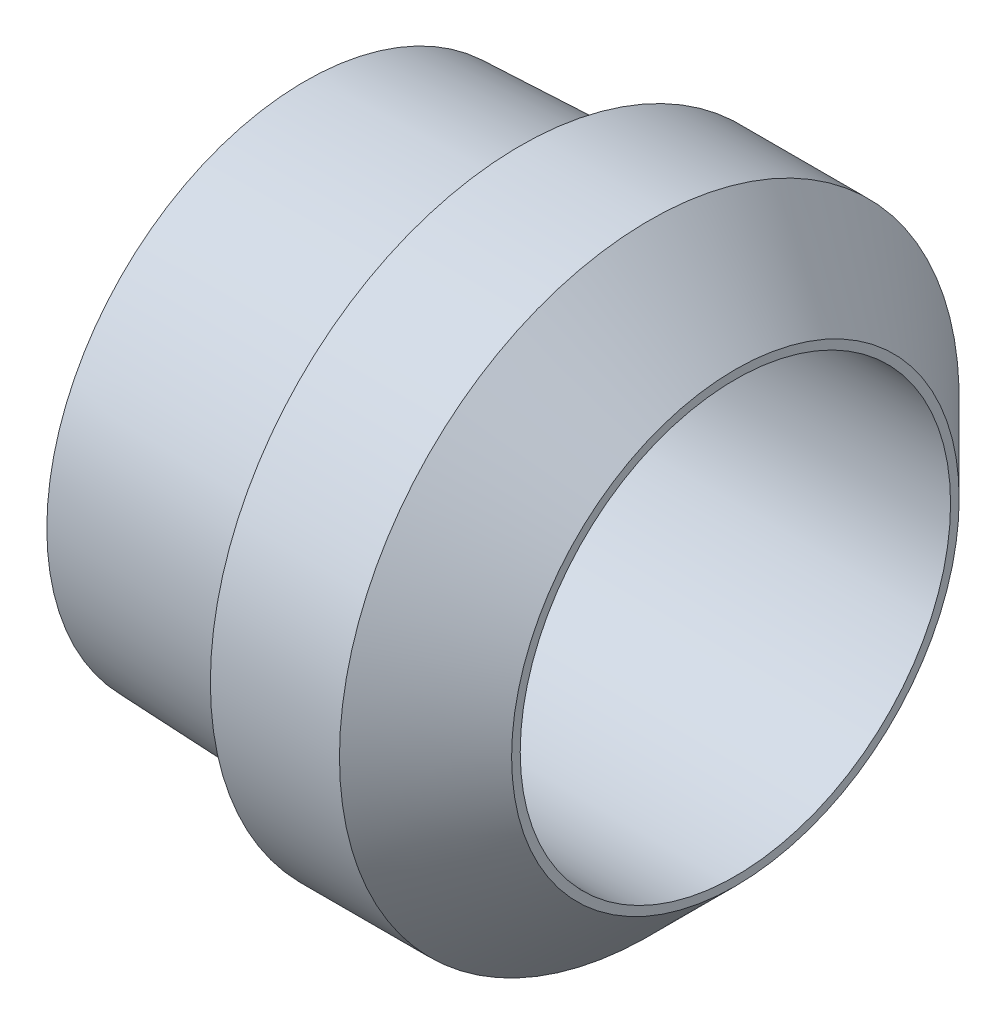
ISO-10303-21;
HEADER;
FILE_DESCRIPTION(('STEP AP214'),'2;1');
FILE_NAME('part.step','',(''),(''),'','','');
FILE_SCHEMA(('AUTOMOTIVE_DESIGN { 1 0 10303 214 1 1 1 1 }'));
ENDSEC;
DATA;
#1=APPLICATION_CONTEXT('core data for automotive mechanical design processes');
#2=APPLICATION_PROTOCOL_DEFINITION('international standard','automotive_design',2000,#1);
#3=PRODUCT_CONTEXT('',#1,'mechanical');
#4=PRODUCT('Part','Part','',(#3));
#5=PRODUCT_RELATED_PRODUCT_CATEGORY('part','',(#4));
#6=PRODUCT_DEFINITION_FORMATION('','',#4);
#7=PRODUCT_DEFINITION_CONTEXT('part definition',#1,'design');
#8=PRODUCT_DEFINITION('design','',#6,#7);
#9=PRODUCT_DEFINITION_SHAPE('','',#8);
#10=(LENGTH_UNIT() NAMED_UNIT(*) SI_UNIT(.MILLI.,.METRE.));
#11=(NAMED_UNIT(*) PLANE_ANGLE_UNIT() SI_UNIT($,.RADIAN.));
#12=(NAMED_UNIT(*) SI_UNIT($,.STERADIAN.) SOLID_ANGLE_UNIT());
#13=UNCERTAINTY_MEASURE_WITH_UNIT(LENGTH_MEASURE(1.E-05),#10,'distance_accuracy_value','');
#14=(GEOMETRIC_REPRESENTATION_CONTEXT(3) GLOBAL_UNCERTAINTY_ASSIGNED_CONTEXT((#13)) GLOBAL_UNIT_ASSIGNED_CONTEXT((#10,
#11,#12)) REPRESENTATION_CONTEXT('',''));
#15=CARTESIAN_POINT('',(0.,0.,0.));
#16=DIRECTION('',(0.,0.,1.));
#17=DIRECTION('',(1.,0.,0.));
#18=AXIS2_PLACEMENT_3D('',#15,#16,#17);
#19=CARTESIAN_POINT('',(-12.,0.,0.));
#20=DIRECTION('',(-1.,0.,0.));
#21=DIRECTION('',(0.,0.,1.));
#22=AXIS2_PLACEMENT_3D('',#19,#20,#21);
#23=CYLINDRICAL_SURFACE('',#22,5.);
#24=CARTESIAN_POINT('',(10.,0.,0.));
#25=DIRECTION('',(-1.,0.,0.));
#26=DIRECTION('',(0.,0.,1.));
#27=AXIS2_PLACEMENT_3D('',#24,#25,#26);
#28=CIRCLE('',#27,5.);
#29=CARTESIAN_POINT('',(10.,0.,5.));
#30=VERTEX_POINT('',#29);
#31=EDGE_CURVE('E60',#30,#30,#28,.T.);
#32=ORIENTED_EDGE('',*,*,#31,.F.);
#33=EDGE_LOOP('',(#32));
#34=FACE_BOUND('',#33,.T.);
#35=CARTESIAN_POINT('',(0.,0.,0.));
#36=DIRECTION('',(-1.,0.,0.));
#37=DIRECTION('',(0.,0.,1.));
#38=AXIS2_PLACEMENT_3D('',#35,#36,#37);
#39=CIRCLE('',#38,5.);
#40=CARTESIAN_POINT('',(0.,0.,5.));
#41=VERTEX_POINT('',#40);
#42=EDGE_CURVE('E10',#41,#41,#39,.T.);
#43=ORIENTED_EDGE('',*,*,#42,.T.);
#44=EDGE_LOOP('',(#43));
#45=FACE_BOUND('',#44,.T.);
#46=ADVANCED_FACE('F35',(#34,#45),#23,.F.);
#47=CARTESIAN_POINT('',(0.,5.,0.));
#48=DIRECTION('',(1.,0.,0.));
#49=DIRECTION('',(0.,0.,-1.));
#50=AXIS2_PLACEMENT_3D('',#47,#48,#49);
#51=PLANE('',#50);
#52=ORIENTED_EDGE('',*,*,#42,.F.);
#53=EDGE_LOOP('',(#52));
#54=FACE_BOUND('',#53,.T.);
#55=CARTESIAN_POINT('',(0.,0.,0.));
#56=DIRECTION('',(-1.,0.,0.));
#57=DIRECTION('',(0.,0.,1.));
#58=AXIS2_PLACEMENT_3D('',#55,#56,#57);
#59=CIRCLE('',#58,6.);
#60=CARTESIAN_POINT('',(0.,0.,6.));
#61=VERTEX_POINT('',#60);
#62=EDGE_CURVE('E41',#61,#61,#59,.T.);
#63=ORIENTED_EDGE('',*,*,#62,.T.);
#64=EDGE_LOOP('',(#63));
#65=FACE_BOUND('',#64,.T.);
#66=ADVANCED_FACE('F67',(#54,#65),#51,.F.);
#67=CARTESIAN_POINT('',(5.,0.,0.));
#68=DIRECTION('',(1.,0.,0.));
#69=DIRECTION('',(0.,0.,-1.));
#70=AXIS2_PLACEMENT_3D('',#67,#68,#69);
#71=CONICAL_SURFACE('',#70,6.2,0.0399786871232903);
#72=ORIENTED_EDGE('',*,*,#62,.F.);
#73=EDGE_LOOP('',(#72));
#74=FACE_BOUND('',#73,.T.);
#75=CARTESIAN_POINT('',(5.,0.,0.));
#76=DIRECTION('',(-1.,0.,0.));
#77=DIRECTION('',(0.,0.,1.));
#78=AXIS2_PLACEMENT_3D('',#75,#76,#77);
#79=CIRCLE('',#78,6.2);
#80=CARTESIAN_POINT('',(5.,0.,6.2));
#81=VERTEX_POINT('',#80);
#82=EDGE_CURVE('E45',#81,#81,#79,.T.);
#83=ORIENTED_EDGE('',*,*,#82,.T.);
#84=EDGE_LOOP('',(#83));
#85=FACE_BOUND('',#84,.T.);
#86=ADVANCED_FACE('F71',(#74,#85),#71,.T.);
#87=CARTESIAN_POINT('',(5.,6.2,0.));
#88=DIRECTION('',(1.,0.,0.));
#89=DIRECTION('',(0.,0.,-1.));
#90=AXIS2_PLACEMENT_3D('',#87,#88,#89);
#91=PLANE('',#90);
#92=ORIENTED_EDGE('',*,*,#82,.F.);
#93=EDGE_LOOP('',(#92));
#94=FACE_BOUND('',#93,.T.);
#95=CARTESIAN_POINT('',(5.,0.,0.));
#96=DIRECTION('',(-1.,0.,0.));
#97=DIRECTION('',(0.,0.,1.));
#98=AXIS2_PLACEMENT_3D('',#95,#96,#97);
#99=CIRCLE('',#98,7.2);
#100=CARTESIAN_POINT('',(5.,0.,7.2));
#101=VERTEX_POINT('',#100);
#102=EDGE_CURVE('E49',#101,#101,#99,.T.);
#103=ORIENTED_EDGE('',*,*,#102,.T.);
#104=EDGE_LOOP('',(#103));
#105=FACE_BOUND('',#104,.T.);
#106=ADVANCED_FACE('F76',(#94,#105),#91,.F.);
#107=CARTESIAN_POINT('',(-12.,0.,0.));
#108=DIRECTION('',(-1.,0.,0.));
#109=DIRECTION('',(0.,0.,1.));
#110=AXIS2_PLACEMENT_3D('',#107,#108,#109);
#111=CYLINDRICAL_SURFACE('',#110,7.2);
#112=ORIENTED_EDGE('',*,*,#102,.F.);
#113=EDGE_LOOP('',(#112));
#114=FACE_BOUND('',#113,.T.);
#115=CARTESIAN_POINT('',(8.00000000000001,0.,0.));
#116=DIRECTION('',(-1.,0.,0.));
#117=DIRECTION('',(0.,0.,1.));
#118=AXIS2_PLACEMENT_3D('',#115,#116,#117);
#119=CIRCLE('',#118,7.2);
#120=CARTESIAN_POINT('',(8.00000000000001,0.,7.2));
#121=VERTEX_POINT('',#120);
#122=EDGE_CURVE('E54',#121,#121,#119,.T.);
#123=ORIENTED_EDGE('',*,*,#122,.T.);
#124=EDGE_LOOP('',(#123));
#125=FACE_BOUND('',#124,.T.);
#126=ADVANCED_FACE('F82',(#114,#125),#111,.T.);
#127=CARTESIAN_POINT('',(10.,0.,0.));
#128=DIRECTION('',(-1.,0.,0.));
#129=DIRECTION('',(0.,0.,1.));
#130=AXIS2_PLACEMENT_3D('',#127,#128,#129);
#131=CONICAL_SURFACE('',#130,5.19999999999999,0.78539816339745);
#132=ORIENTED_EDGE('',*,*,#122,.F.);
#133=EDGE_LOOP('',(#132));
#134=FACE_BOUND('',#133,.T.);
#135=CARTESIAN_POINT('',(10.,0.,0.));
#136=DIRECTION('',(-1.,0.,0.));
#137=DIRECTION('',(0.,0.,1.));
#138=AXIS2_PLACEMENT_3D('',#135,#136,#137);
#139=CIRCLE('',#138,5.19999999999999);
#140=CARTESIAN_POINT('',(10.,0.,5.19999999999999));
#141=VERTEX_POINT('',#140);
#142=EDGE_CURVE('E57',#141,#141,#139,.T.);
#143=ORIENTED_EDGE('',*,*,#142,.T.);
#144=EDGE_LOOP('',(#143));
#145=FACE_BOUND('',#144,.T.);
#146=ADVANCED_FACE('F86',(#134,#145),#131,.T.);
#147=CARTESIAN_POINT('',(10.,5.19999999999999,0.));
#148=DIRECTION('',(-1.,0.,0.));
#149=DIRECTION('',(0.,0.,1.));
#150=AXIS2_PLACEMENT_3D('',#147,#148,#149);
#151=PLANE('',#150);
#152=ORIENTED_EDGE('',*,*,#142,.F.);
#153=EDGE_LOOP('',(#152));
#154=FACE_BOUND('',#153,.T.);
#155=ORIENTED_EDGE('',*,*,#31,.T.);
#156=EDGE_LOOP('',(#155));
#157=FACE_BOUND('',#156,.T.);
#158=ADVANCED_FACE('F64',(#154,#157),#151,.F.);
#159=CLOSED_SHELL('',(#46,#66,#86,#106,#126,#146,#158));
#160=MANIFOLD_SOLID_BREP('B2',#159);
#161=ADVANCED_BREP_SHAPE_REPRESENTATION('',(#18,#160),#14);
#162=SHAPE_DEFINITION_REPRESENTATION(#9,#161);
ENDSEC;
END-ISO-10303-21;
